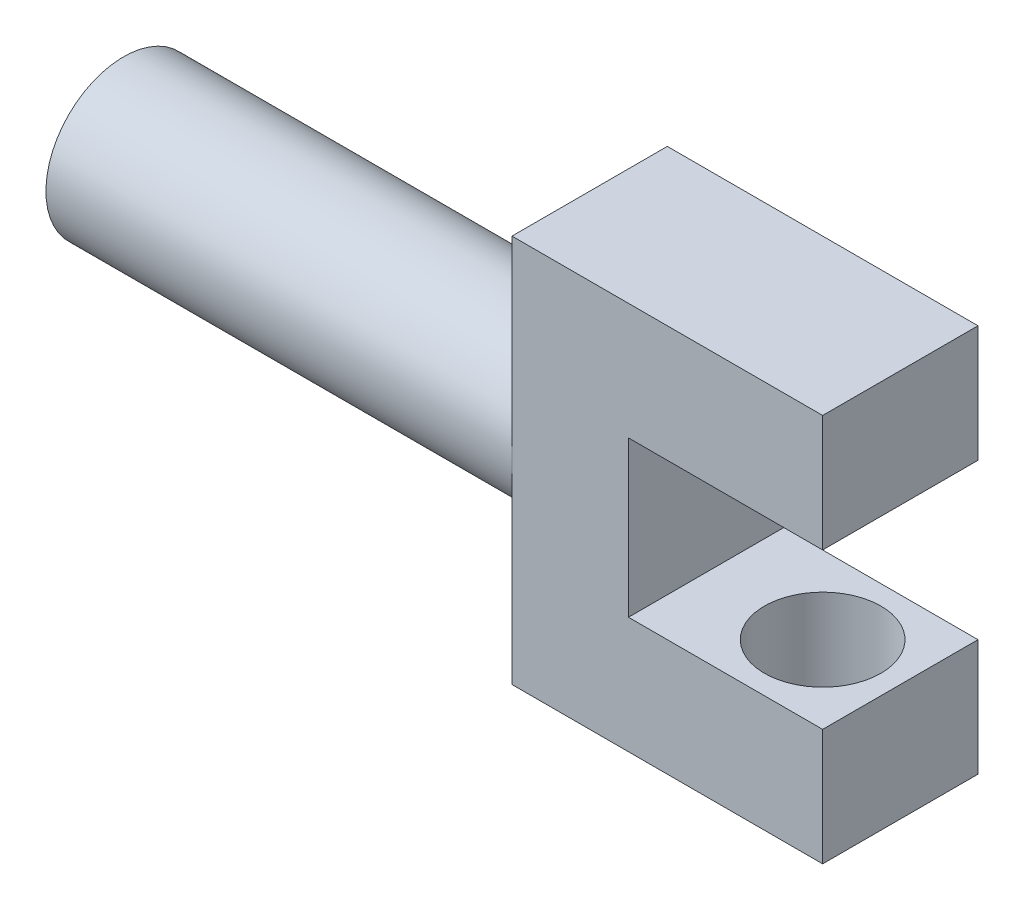
ISO-10303-21;
HEADER;
FILE_DESCRIPTION(('STEP AP214'),'2;1');
FILE_NAME('part.step','',(''),(''),'','','');
FILE_SCHEMA(('AUTOMOTIVE_DESIGN { 1 0 10303 214 1 1 1 1 }'));
ENDSEC;
DATA;
#1=APPLICATION_CONTEXT('core data for automotive mechanical design processes');
#2=APPLICATION_PROTOCOL_DEFINITION('international standard','automotive_design',2000,#1);
#3=PRODUCT_CONTEXT('',#1,'mechanical');
#4=PRODUCT('Part','Part','',(#3));
#5=PRODUCT_RELATED_PRODUCT_CATEGORY('part','',(#4));
#6=PRODUCT_DEFINITION_FORMATION('','',#4);
#7=PRODUCT_DEFINITION_CONTEXT('part definition',#1,'design');
#8=PRODUCT_DEFINITION('design','',#6,#7);
#9=PRODUCT_DEFINITION_SHAPE('','',#8);
#10=(LENGTH_UNIT() NAMED_UNIT(*) SI_UNIT(.MILLI.,.METRE.));
#11=(NAMED_UNIT(*) PLANE_ANGLE_UNIT() SI_UNIT($,.RADIAN.));
#12=(NAMED_UNIT(*) SI_UNIT($,.STERADIAN.) SOLID_ANGLE_UNIT());
#13=UNCERTAINTY_MEASURE_WITH_UNIT(LENGTH_MEASURE(1.E-05),#10,'distance_accuracy_value','');
#14=(GEOMETRIC_REPRESENTATION_CONTEXT(3) GLOBAL_UNCERTAINTY_ASSIGNED_CONTEXT((#13)) GLOBAL_UNIT_ASSIGNED_CONTEXT((#10,
#11,#12)) REPRESENTATION_CONTEXT('',''));
#15=CARTESIAN_POINT('',(0.,0.,0.));
#16=DIRECTION('',(0.,0.,1.));
#17=DIRECTION('',(1.,0.,0.));
#18=AXIS2_PLACEMENT_3D('',#15,#16,#17);
#19=CARTESIAN_POINT('',(0.,25.,10.));
#20=DIRECTION('',(1.,0.,0.));
#21=DIRECTION('',(0.,1.,0.));
#22=AXIS2_PLACEMENT_3D('',#19,#20,#21);
#23=PLANE('',#22);
#24=CARTESIAN_POINT('',(0.,0.,0.));
#25=DIRECTION('',(-1.,0.,0.));
#26=DIRECTION('',(0.,-1.,0.));
#27=AXIS2_PLACEMENT_3D('',#24,#25,#26);
#28=CIRCLE('',#27,10.);
#29=CARTESIAN_POINT('',(0.,0.,10.));
#30=VERTEX_POINT('',#29);
#31=CARTESIAN_POINT('',(0.,0.,-10.));
#32=VERTEX_POINT('',#31);
#33=EDGE_CURVE('E57',#30,#32,#28,.T.);
#34=ORIENTED_EDGE('',*,*,#33,.F.);
#35=DIRECTION('',(0.,-1.,0.));
#36=VECTOR('',#35,1.);
#37=CARTESIAN_POINT('',(0.,25.,10.));
#38=LINE('',#37,#36);
#39=CARTESIAN_POINT('',(0.,25.,10.));
#40=VERTEX_POINT('',#39);
#41=EDGE_CURVE('E112',#40,#30,#38,.T.);
#42=ORIENTED_EDGE('',*,*,#41,.F.);
#43=DIRECTION('',(0.,0.,-1.));
#44=VECTOR('',#43,1.);
#45=CARTESIAN_POINT('',(0.,25.,10.));
#46=LINE('',#45,#44);
#47=CARTESIAN_POINT('',(0.,25.,-10.));
#48=VERTEX_POINT('',#47);
#49=EDGE_CURVE('E55',#40,#48,#46,.T.);
#50=ORIENTED_EDGE('',*,*,#49,.T.);
#51=DIRECTION('',(0.,-1.,0.));
#52=VECTOR('',#51,1.);
#53=CARTESIAN_POINT('',(0.,25.,-10.));
#54=LINE('',#53,#52);
#55=EDGE_CURVE('E165',#48,#32,#54,.T.);
#56=ORIENTED_EDGE('',*,*,#55,.T.);
#57=EDGE_LOOP('',(#34,#42,#50,#56));
#58=FACE_BOUND('',#57,.T.);
#59=ADVANCED_FACE('F45',(#58),#23,.F.);
#60=CARTESIAN_POINT('',(0.,25.,10.));
#61=DIRECTION('',(0.,-1.,0.));
#62=DIRECTION('',(0.,0.,-1.));
#63=AXIS2_PLACEMENT_3D('',#60,#61,#62);
#64=PLANE('',#63);
#65=DIRECTION('',(-1.,0.,0.));
#66=VECTOR('',#65,1.);
#67=CARTESIAN_POINT('',(0.,25.,-10.));
#68=LINE('',#67,#66);
#69=CARTESIAN_POINT('',(40.,25.,-10.));
#70=VERTEX_POINT('',#69);
#71=EDGE_CURVE('E159',#70,#48,#68,.T.);
#72=ORIENTED_EDGE('',*,*,#71,.T.);
#73=ORIENTED_EDGE('',*,*,#49,.F.);
#74=DIRECTION('',(-1.,0.,0.));
#75=VECTOR('',#74,1.);
#76=CARTESIAN_POINT('',(0.,25.,10.));
#77=LINE('',#76,#75);
#78=CARTESIAN_POINT('',(40.,25.,10.));
#79=VERTEX_POINT('',#78);
#80=EDGE_CURVE('E185',#79,#40,#77,.T.);
#81=ORIENTED_EDGE('',*,*,#80,.F.);
#82=DIRECTION('',(0.,0.,-1.));
#83=VECTOR('',#82,1.);
#84=CARTESIAN_POINT('',(40.,25.,10.));
#85=LINE('',#84,#83);
#86=EDGE_CURVE('E155',#79,#70,#85,.T.);
#87=ORIENTED_EDGE('',*,*,#86,.T.);
#88=EDGE_LOOP('',(#72,#73,#81,#87));
#89=FACE_BOUND('',#88,.T.);
#90=ADVANCED_FACE('F47',(#89),#64,.F.);
#91=EDGE_CURVE('E11',#32,#30,#28,.T.);
#92=ORIENTED_EDGE('',*,*,#91,.F.);
#93=CARTESIAN_POINT('',(0.,-25.,-10.));
#94=VERTEX_POINT('',#93);
#95=EDGE_CURVE('E163',#32,#94,#54,.T.);
#96=ORIENTED_EDGE('',*,*,#95,.T.);
#97=DIRECTION('',(0.,0.,-1.));
#98=VECTOR('',#97,1.);
#99=CARTESIAN_POINT('',(0.,-25.,10.));
#100=LINE('',#99,#98);
#101=CARTESIAN_POINT('',(0.,-25.,10.));
#102=VERTEX_POINT('',#101);
#103=EDGE_CURVE('E200',#102,#94,#100,.T.);
#104=ORIENTED_EDGE('',*,*,#103,.F.);
#105=EDGE_CURVE('E238',#30,#102,#38,.T.);
#106=ORIENTED_EDGE('',*,*,#105,.F.);
#107=EDGE_LOOP('',(#92,#96,#104,#106));
#108=FACE_BOUND('',#107,.T.);
#109=ADVANCED_FACE('F250',(#108),#23,.F.);
#110=CARTESIAN_POINT('',(0.,-25.,10.));
#111=DIRECTION('',(0.,1.,0.));
#112=DIRECTION('',(0.,0.,1.));
#113=AXIS2_PLACEMENT_3D('',#110,#111,#112);
#114=PLANE('',#113);
#115=DIRECTION('',(1.,0.,0.));
#116=VECTOR('',#115,1.);
#117=CARTESIAN_POINT('',(0.,-25.,-10.));
#118=LINE('',#117,#116);
#119=CARTESIAN_POINT('',(39.9999999999999,-25.,-10.));
#120=VERTEX_POINT('',#119);
#121=EDGE_CURVE('E169',#94,#120,#118,.T.);
#122=ORIENTED_EDGE('',*,*,#121,.T.);
#123=DIRECTION('',(0.,0.,-1.));
#124=VECTOR('',#123,1.);
#125=CARTESIAN_POINT('',(39.9999999999999,-25.,10.));
#126=LINE('',#125,#124);
#127=CARTESIAN_POINT('',(39.9999999999999,-25.,10.));
#128=VERTEX_POINT('',#127);
#129=EDGE_CURVE('E196',#128,#120,#126,.T.);
#130=ORIENTED_EDGE('',*,*,#129,.F.);
#131=DIRECTION('',(1.,0.,0.));
#132=VECTOR('',#131,1.);
#133=CARTESIAN_POINT('',(0.,-25.,10.));
#134=LINE('',#133,#132);
#135=EDGE_CURVE('E241',#102,#128,#134,.T.);
#136=ORIENTED_EDGE('',*,*,#135,.F.);
#137=ORIENTED_EDGE('',*,*,#103,.T.);
#138=EDGE_LOOP('',(#122,#130,#136,#137));
#139=FACE_BOUND('',#138,.T.);
#140=ADVANCED_FACE('F252',(#139),#114,.F.);
#141=CARTESIAN_POINT('',(39.9999999999999,-25.,10.));
#142=DIRECTION('',(-1.,0.,0.));
#143=DIRECTION('',(0.,0.,1.));
#144=AXIS2_PLACEMENT_3D('',#141,#142,#143);
#145=PLANE('',#144);
#146=DIRECTION('',(0.,1.,0.));
#147=VECTOR('',#146,1.);
#148=CARTESIAN_POINT('',(39.9999999999999,-25.,-10.));
#149=LINE('',#148,#147);
#150=CARTESIAN_POINT('',(39.9999999999999,-10.,-10.));
#151=VERTEX_POINT('',#150);
#152=EDGE_CURVE('E172',#120,#151,#149,.T.);
#153=ORIENTED_EDGE('',*,*,#152,.T.);
#154=DIRECTION('',(0.,0.,-1.));
#155=VECTOR('',#154,1.);
#156=CARTESIAN_POINT('',(39.9999999999999,-10.,10.));
#157=LINE('',#156,#155);
#158=CARTESIAN_POINT('',(39.9999999999999,-10.,10.));
#159=VERTEX_POINT('',#158);
#160=EDGE_CURVE('E192',#159,#151,#157,.T.);
#161=ORIENTED_EDGE('',*,*,#160,.F.);
#162=DIRECTION('',(0.,1.,0.));
#163=VECTOR('',#162,1.);
#164=CARTESIAN_POINT('',(39.9999999999999,-25.,10.));
#165=LINE('',#164,#163);
#166=EDGE_CURVE('E244',#128,#159,#165,.T.);
#167=ORIENTED_EDGE('',*,*,#166,.F.);
#168=ORIENTED_EDGE('',*,*,#129,.T.);
#169=EDGE_LOOP('',(#153,#161,#167,#168));
#170=FACE_BOUND('',#169,.T.);
#171=ADVANCED_FACE('F256',(#170),#145,.F.);
#172=CARTESIAN_POINT('',(39.9999999999999,-10.,10.));
#173=DIRECTION('',(0.,-1.,0.));
#174=DIRECTION('',(1.,0.,0.));
#175=AXIS2_PLACEMENT_3D('',#172,#173,#174);
#176=PLANE('',#175);
#177=CARTESIAN_POINT('',(30.,-10.,0.));
#178=DIRECTION('',(0.,-1.,0.));
#179=DIRECTION('',(1.,0.,0.));
#180=AXIS2_PLACEMENT_3D('',#177,#178,#179);
#181=CIRCLE('',#180,7.5);
#182=CARTESIAN_POINT('',(37.5,-10.,0.));
#183=VERTEX_POINT('',#182);
#184=EDGE_CURVE('E220',#183,#183,#181,.F.);
#185=ORIENTED_EDGE('',*,*,#184,.F.);
#186=EDGE_LOOP('',(#185));
#187=FACE_BOUND('',#186,.T.);
#188=DIRECTION('',(-1.,0.,0.));
#189=VECTOR('',#188,1.);
#190=CARTESIAN_POINT('',(39.9999999999999,-10.,-10.));
#191=LINE('',#190,#189);
#192=CARTESIAN_POINT('',(15.,-10.,-10.));
#193=VERTEX_POINT('',#192);
#194=EDGE_CURVE('E175',#151,#193,#191,.T.);
#195=ORIENTED_EDGE('',*,*,#194,.T.);
#196=DIRECTION('',(0.,0.,-1.));
#197=VECTOR('',#196,1.);
#198=CARTESIAN_POINT('',(15.,-10.,10.));
#199=LINE('',#198,#197);
#200=CARTESIAN_POINT('',(15.,-10.,10.));
#201=VERTEX_POINT('',#200);
#202=EDGE_CURVE('E148',#201,#193,#199,.T.);
#203=ORIENTED_EDGE('',*,*,#202,.F.);
#204=DIRECTION('',(-1.,0.,0.));
#205=VECTOR('',#204,1.);
#206=CARTESIAN_POINT('',(39.9999999999999,-10.,10.));
#207=LINE('',#206,#205);
#208=EDGE_CURVE('E134',#159,#201,#207,.T.);
#209=ORIENTED_EDGE('',*,*,#208,.F.);
#210=ORIENTED_EDGE('',*,*,#160,.T.);
#211=EDGE_LOOP('',(#195,#203,#209,#210));
#212=FACE_BOUND('',#211,.T.);
#213=ADVANCED_FACE('F259',(#187,#212),#176,.F.);
#214=CARTESIAN_POINT('',(15.,10.,10.));
#215=DIRECTION('',(-1.,0.,0.));
#216=DIRECTION('',(0.,-1.,0.));
#217=AXIS2_PLACEMENT_3D('',#214,#215,#216);
#218=PLANE('',#217);
#219=DIRECTION('',(0.,1.,0.));
#220=VECTOR('',#219,1.);
#221=CARTESIAN_POINT('',(15.,10.,-10.));
#222=LINE('',#221,#220);
#223=CARTESIAN_POINT('',(15.,10.,-10.));
#224=VERTEX_POINT('',#223);
#225=EDGE_CURVE('E144',#193,#224,#222,.T.);
#226=ORIENTED_EDGE('',*,*,#225,.T.);
#227=DIRECTION('',(0.,0.,-1.));
#228=VECTOR('',#227,1.);
#229=CARTESIAN_POINT('',(15.,10.,10.));
#230=LINE('',#229,#228);
#231=CARTESIAN_POINT('',(15.,10.,10.));
#232=VERTEX_POINT('',#231);
#233=EDGE_CURVE('E141',#232,#224,#230,.T.);
#234=ORIENTED_EDGE('',*,*,#233,.F.);
#235=DIRECTION('',(0.,1.,0.));
#236=VECTOR('',#235,1.);
#237=CARTESIAN_POINT('',(15.,10.,10.));
#238=LINE('',#237,#236);
#239=EDGE_CURVE('E127',#201,#232,#238,.T.);
#240=ORIENTED_EDGE('',*,*,#239,.F.);
#241=ORIENTED_EDGE('',*,*,#202,.T.);
#242=EDGE_LOOP('',(#226,#234,#240,#241));
#243=FACE_BOUND('',#242,.T.);
#244=ADVANCED_FACE('F142',(#243),#218,.F.);
#245=CARTESIAN_POINT('',(40.,10.,10.));
#246=DIRECTION('',(0.,1.,0.));
#247=DIRECTION('',(-1.,0.,0.));
#248=AXIS2_PLACEMENT_3D('',#245,#246,#247);
#249=PLANE('',#248);
#250=CARTESIAN_POINT('',(30.,10.,0.));
#251=DIRECTION('',(0.,1.,0.));
#252=DIRECTION('',(-1.,0.,0.));
#253=AXIS2_PLACEMENT_3D('',#250,#251,#252);
#254=CIRCLE('',#253,7.5);
#255=CARTESIAN_POINT('',(22.5,10.,0.));
#256=VERTEX_POINT('',#255);
#257=EDGE_CURVE('E49',#256,#256,#254,.F.);
#258=ORIENTED_EDGE('',*,*,#257,.F.);
#259=EDGE_LOOP('',(#258));
#260=FACE_BOUND('',#259,.T.);
#261=DIRECTION('',(1.,0.,0.));
#262=VECTOR('',#261,1.);
#263=CARTESIAN_POINT('',(40.,10.,-10.));
#264=LINE('',#263,#262);
#265=CARTESIAN_POINT('',(40.,10.,-10.));
#266=VERTEX_POINT('',#265);
#267=EDGE_CURVE('E180',#224,#266,#264,.T.);
#268=ORIENTED_EDGE('',*,*,#267,.T.);
#269=DIRECTION('',(0.,0.,-1.));
#270=VECTOR('',#269,1.);
#271=CARTESIAN_POINT('',(40.,10.,10.));
#272=LINE('',#271,#270);
#273=CARTESIAN_POINT('',(40.,10.,10.));
#274=VERTEX_POINT('',#273);
#275=EDGE_CURVE('E149',#274,#266,#272,.T.);
#276=ORIENTED_EDGE('',*,*,#275,.F.);
#277=DIRECTION('',(1.,0.,0.));
#278=VECTOR('',#277,1.);
#279=CARTESIAN_POINT('',(40.,10.,10.));
#280=LINE('',#279,#278);
#281=EDGE_CURVE('E131',#232,#274,#280,.T.);
#282=ORIENTED_EDGE('',*,*,#281,.F.);
#283=ORIENTED_EDGE('',*,*,#233,.T.);
#284=EDGE_LOOP('',(#268,#276,#282,#283));
#285=FACE_BOUND('',#284,.T.);
#286=ADVANCED_FACE('F151',(#260,#285),#249,.F.);
#287=CARTESIAN_POINT('',(40.,25.,10.));
#288=DIRECTION('',(-1.,0.,0.));
#289=DIRECTION('',(0.,0.,1.));
#290=AXIS2_PLACEMENT_3D('',#287,#288,#289);
#291=PLANE('',#290);
#292=DIRECTION('',(0.,1.,0.));
#293=VECTOR('',#292,1.);
#294=CARTESIAN_POINT('',(40.,25.,-10.));
#295=LINE('',#294,#293);
#296=EDGE_CURVE('E103',#266,#70,#295,.T.);
#297=ORIENTED_EDGE('',*,*,#296,.T.);
#298=ORIENTED_EDGE('',*,*,#86,.F.);
#299=DIRECTION('',(0.,1.,0.));
#300=VECTOR('',#299,1.);
#301=CARTESIAN_POINT('',(40.,25.,10.));
#302=LINE('',#301,#300);
#303=EDGE_CURVE('E71',#274,#79,#302,.T.);
#304=ORIENTED_EDGE('',*,*,#303,.F.);
#305=ORIENTED_EDGE('',*,*,#275,.T.);
#306=EDGE_LOOP('',(#297,#298,#304,#305));
#307=FACE_BOUND('',#306,.T.);
#308=ADVANCED_FACE('F260',(#307),#291,.F.);
#309=CARTESIAN_POINT('',(0.,0.,10.));
#310=DIRECTION('',(0.,0.,-1.));
#311=DIRECTION('',(-1.,0.,0.));
#312=AXIS2_PLACEMENT_3D('',#309,#310,#311);
#313=PLANE('',#312);
#314=ORIENTED_EDGE('',*,*,#80,.T.);
#315=ORIENTED_EDGE('',*,*,#41,.T.);
#316=ORIENTED_EDGE('',*,*,#105,.T.);
#317=ORIENTED_EDGE('',*,*,#135,.T.);
#318=ORIENTED_EDGE('',*,*,#166,.T.);
#319=ORIENTED_EDGE('',*,*,#208,.T.);
#320=ORIENTED_EDGE('',*,*,#239,.T.);
#321=ORIENTED_EDGE('',*,*,#281,.T.);
#322=ORIENTED_EDGE('',*,*,#303,.T.);
#323=EDGE_LOOP('',(#314,#315,#316,#317,#318,#319,#320,#321,#322));
#324=FACE_BOUND('',#323,.T.);
#325=ADVANCED_FACE('F129',(#324),#313,.F.);
#326=CARTESIAN_POINT('',(0.,0.,-10.));
#327=DIRECTION('',(0.,0.,-1.));
#328=DIRECTION('',(-1.,0.,0.));
#329=AXIS2_PLACEMENT_3D('',#326,#327,#328);
#330=PLANE('',#329);
#331=ORIENTED_EDGE('',*,*,#71,.F.);
#332=ORIENTED_EDGE('',*,*,#296,.F.);
#333=ORIENTED_EDGE('',*,*,#267,.F.);
#334=ORIENTED_EDGE('',*,*,#225,.F.);
#335=ORIENTED_EDGE('',*,*,#194,.F.);
#336=ORIENTED_EDGE('',*,*,#152,.F.);
#337=ORIENTED_EDGE('',*,*,#121,.F.);
#338=ORIENTED_EDGE('',*,*,#95,.F.);
#339=ORIENTED_EDGE('',*,*,#55,.F.);
#340=EDGE_LOOP('',(#331,#332,#333,#334,#335,#336,#337,#338,#339));
#341=FACE_BOUND('',#340,.T.);
#342=ADVANCED_FACE('F210',(#341),#330,.T.);
#343=CARTESIAN_POINT('',(-60.,0.,0.));
#344=DIRECTION('',(1.,0.,0.));
#345=DIRECTION('',(0.,1.,0.));
#346=AXIS2_PLACEMENT_3D('',#343,#344,#345);
#347=CYLINDRICAL_SURFACE('',#346,10.);
#348=CARTESIAN_POINT('',(-60.,0.,0.));
#349=DIRECTION('',(-1.,0.,0.));
#350=DIRECTION('',(0.,-1.,0.));
#351=AXIS2_PLACEMENT_3D('',#348,#349,#350);
#352=CIRCLE('',#351,10.);
#353=CARTESIAN_POINT('',(-60.,-9.99999999999997,0.));
#354=VERTEX_POINT('',#353);
#355=EDGE_CURVE('E164',#354,#354,#352,.T.);
#356=ORIENTED_EDGE('',*,*,#355,.F.);
#357=EDGE_LOOP('',(#356));
#358=FACE_BOUND('',#357,.T.);
#359=ORIENTED_EDGE('',*,*,#33,.T.);
#360=ORIENTED_EDGE('',*,*,#91,.T.);
#361=EDGE_LOOP('',(#359,#360));
#362=FACE_BOUND('',#361,.T.);
#363=ADVANCED_FACE('F360',(#358,#362),#347,.T.);
#364=CARTESIAN_POINT('',(-60.,0.,0.));
#365=DIRECTION('',(-1.,0.,0.));
#366=DIRECTION('',(0.,-1.,0.));
#367=AXIS2_PLACEMENT_3D('',#364,#365,#366);
#368=PLANE('',#367);
#369=ORIENTED_EDGE('',*,*,#355,.T.);
#370=EDGE_LOOP('',(#369));
#371=FACE_BOUND('',#370,.T.);
#372=ADVANCED_FACE('F311',(#371),#368,.T.);
#373=CARTESIAN_POINT('',(30.,22.,0.));
#374=DIRECTION('',(0.,-1.,0.));
#375=DIRECTION('',(1.,0.,0.));
#376=AXIS2_PLACEMENT_3D('',#373,#374,#375);
#377=PLANE('',#376);
#378=CARTESIAN_POINT('',(30.,22.,0.));
#379=DIRECTION('',(0.,-1.,0.));
#380=DIRECTION('',(1.,0.,0.));
#381=AXIS2_PLACEMENT_3D('',#378,#379,#380);
#382=CIRCLE('',#381,7.5);
#383=CARTESIAN_POINT('',(37.5,22.,0.));
#384=VERTEX_POINT('',#383);
#385=EDGE_CURVE('E229',#384,#384,#382,.T.);
#386=ORIENTED_EDGE('',*,*,#385,.T.);
#387=EDGE_LOOP('',(#386));
#388=FACE_BOUND('',#387,.T.);
#389=ADVANCED_FACE('F320',(#388),#377,.T.);
#390=CARTESIAN_POINT('',(30.,-22.,0.));
#391=DIRECTION('',(0.,1.,0.));
#392=DIRECTION('',(-1.,0.,0.));
#393=AXIS2_PLACEMENT_3D('',#390,#391,#392);
#394=CYLINDRICAL_SURFACE('',#393,7.5);
#395=ORIENTED_EDGE('',*,*,#385,.F.);
#396=EDGE_LOOP('',(#395));
#397=FACE_BOUND('',#396,.T.);
#398=ORIENTED_EDGE('',*,*,#257,.T.);
#399=EDGE_LOOP('',(#398));
#400=FACE_BOUND('',#399,.T.);
#401=ADVANCED_FACE('F324',(#397,#400),#394,.F.);
#402=CARTESIAN_POINT('',(30.,-22.,0.));
#403=DIRECTION('',(0.,-1.,0.));
#404=DIRECTION('',(1.,0.,0.));
#405=AXIS2_PLACEMENT_3D('',#402,#403,#404);
#406=CIRCLE('',#405,7.5);
#407=CARTESIAN_POINT('',(37.5,-22.,0.));
#408=VERTEX_POINT('',#407);
#409=EDGE_CURVE('E226',#408,#408,#406,.T.);
#410=ORIENTED_EDGE('',*,*,#409,.T.);
#411=EDGE_LOOP('',(#410));
#412=FACE_BOUND('',#411,.T.);
#413=ORIENTED_EDGE('',*,*,#184,.T.);
#414=EDGE_LOOP('',(#413));
#415=FACE_BOUND('',#414,.T.);
#416=ADVANCED_FACE('F332',(#412,#415),#394,.F.);
#417=CARTESIAN_POINT('',(30.,-22.,0.));
#418=DIRECTION('',(0.,-1.,0.));
#419=DIRECTION('',(1.,0.,0.));
#420=AXIS2_PLACEMENT_3D('',#417,#418,#419);
#421=PLANE('',#420);
#422=ORIENTED_EDGE('',*,*,#409,.F.);
#423=EDGE_LOOP('',(#422));
#424=FACE_BOUND('',#423,.T.);
#425=ADVANCED_FACE('F341',(#424),#421,.F.);
#426=CLOSED_SHELL('',(#59,#90,#109,#140,#171,#213,#244,#286,#308,#325,#342,#363,#372,#389,#401,
#416,#425));
#427=MANIFOLD_SOLID_BREP('B2',#426);
#428=ADVANCED_BREP_SHAPE_REPRESENTATION('',(#18,#427),#14);
#429=SHAPE_DEFINITION_REPRESENTATION(#9,#428);
ENDSEC;
END-ISO-10303-21;
